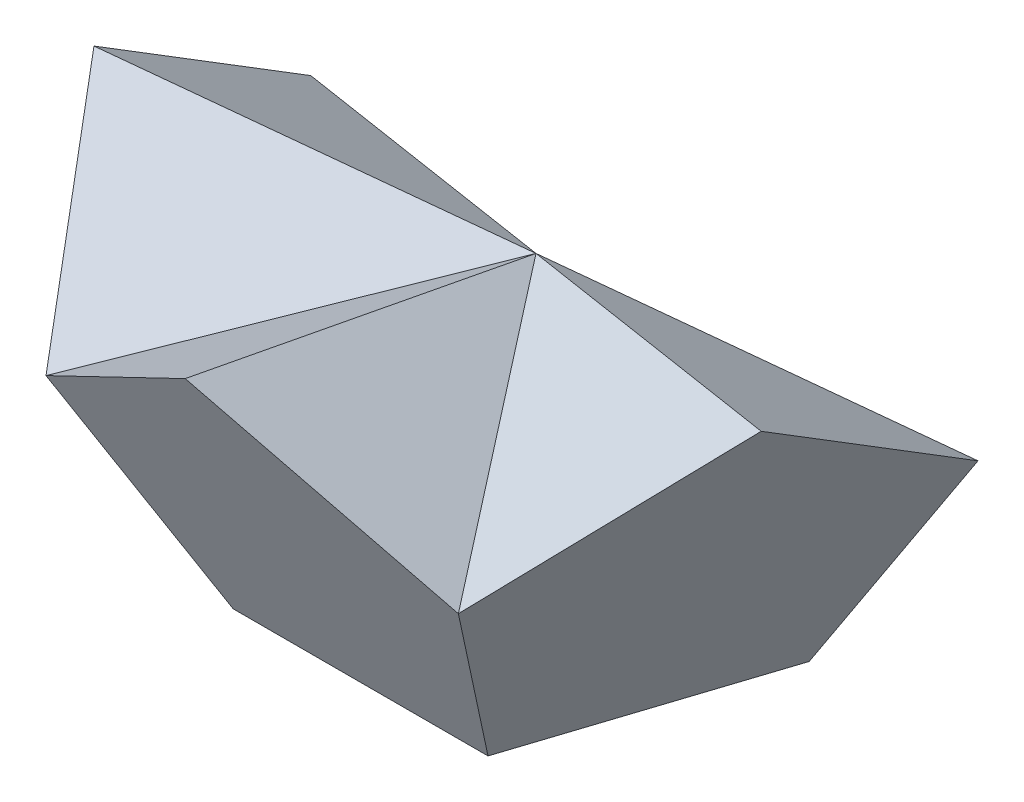
ISO-10303-21;
HEADER;
FILE_DESCRIPTION(('STEP AP214'),'2;1');
FILE_NAME('part.step','',(''),(''),'','','');
FILE_SCHEMA(('AUTOMOTIVE_DESIGN { 1 0 10303 214 1 1 1 1 }'));
ENDSEC;
DATA;
#1=APPLICATION_CONTEXT('core data for automotive mechanical design processes');
#2=APPLICATION_PROTOCOL_DEFINITION('international standard','automotive_design',2000,#1);
#3=PRODUCT_CONTEXT('',#1,'mechanical');
#4=PRODUCT('Part','Part','',(#3));
#5=PRODUCT_RELATED_PRODUCT_CATEGORY('part','',(#4));
#6=PRODUCT_DEFINITION_FORMATION('','',#4);
#7=PRODUCT_DEFINITION_CONTEXT('part definition',#1,'design');
#8=PRODUCT_DEFINITION('design','',#6,#7);
#9=PRODUCT_DEFINITION_SHAPE('','',#8);
#10=(LENGTH_UNIT() NAMED_UNIT(*) SI_UNIT(.MILLI.,.METRE.));
#11=(NAMED_UNIT(*) PLANE_ANGLE_UNIT() SI_UNIT($,.RADIAN.));
#12=(NAMED_UNIT(*) SI_UNIT($,.STERADIAN.) SOLID_ANGLE_UNIT());
#13=UNCERTAINTY_MEASURE_WITH_UNIT(LENGTH_MEASURE(1.E-05),#10,'distance_accuracy_value','');
#14=(GEOMETRIC_REPRESENTATION_CONTEXT(3) GLOBAL_UNCERTAINTY_ASSIGNED_CONTEXT((#13)) GLOBAL_UNIT_ASSIGNED_CONTEXT((#10,
#11,#12)) REPRESENTATION_CONTEXT('',''));
#15=CARTESIAN_POINT('',(0.,0.,0.));
#16=DIRECTION('',(0.,0.,1.));
#17=DIRECTION('',(1.,0.,0.));
#18=AXIS2_PLACEMENT_3D('',#15,#16,#17);
#19=CARTESIAN_POINT('',(10.2745158285618,0.,-3.33839256195651));
#20=DIRECTION('',(0.499999999999999,0.525731112119135,-0.688190960235587));
#21=DIRECTION('',(0.,0.794654472291766,0.607061998206687));
#22=AXIS2_PLACEMENT_3D('',#19,#20,#21);
#23=PLANE('',#22);
#24=DIRECTION('',(-0.809016994374948,0.,-0.587785252292472));
#25=VECTOR('',#24,1.);
#26=CARTESIAN_POINT('',(10.2745158285618,0.,-3.33839256195651));
#27=LINE('',#26,#25);
#28=CARTESIAN_POINT('',(10.2745158285618,0.,-3.33839256195651));
#29=VERTEX_POINT('',#28);
#30=CARTESIAN_POINT('',(0.,0.,-10.8032652660709));
#31=VERTEX_POINT('',#30);
#32=EDGE_CURVE('E171',#29,#31,#27,.T.);
#33=ORIENTED_EDGE('',*,*,#32,.T.);
#34=DIRECTION('',(0.,-0.794654472291765,-0.607061998206687));
#35=VECTOR('',#34,1.);
#36=CARTESIAN_POINT('',(0.,0.,-10.8032652660709));
#37=LINE('',#36,#35);
#38=CARTESIAN_POINT('',(0.,14.1416578280274,0.));
#39=VERTEX_POINT('',#38);
#40=EDGE_CURVE('E11',#39,#31,#37,.T.);
#41=ORIENTED_EDGE('',*,*,#40,.F.);
#42=DIRECTION('',(0.577350269189626,-0.794654472291765,-0.187592474085081));
#43=VECTOR('',#42,1.);
#44=CARTESIAN_POINT('',(10.2745158285618,0.,-3.33839256195651));
#45=LINE('',#44,#43);
#46=EDGE_CURVE('E60',#39,#29,#45,.T.);
#47=ORIENTED_EDGE('',*,*,#46,.T.);
#48=EDGE_LOOP('',(#33,#41,#47));
#49=FACE_BOUND('',#48,.T.);
#50=ADVANCED_FACE('F40',(#49),#23,.T.);
#51=CARTESIAN_POINT('',(0.,0.,-10.8032652660709));
#52=DIRECTION('',(-0.500000000000001,0.525731112119135,-0.688190960235585));
#53=DIRECTION('',(0.,0.794654472291765,0.607061998206688));
#54=AXIS2_PLACEMENT_3D('',#51,#52,#53);
#55=PLANE('',#54);
#56=DIRECTION('',(-0.809016994374946,0.,0.587785252292474));
#57=VECTOR('',#56,1.);
#58=CARTESIAN_POINT('',(0.,0.,-10.8032652660709));
#59=LINE('',#58,#57);
#60=CARTESIAN_POINT('',(-10.2745158285618,0.,-3.33839256195648));
#61=VERTEX_POINT('',#60);
#62=EDGE_CURVE('E67',#31,#61,#59,.T.);
#63=ORIENTED_EDGE('',*,*,#62,.T.);
#64=DIRECTION('',(-0.577350269189627,-0.794654472291765,-0.187592474085079));
#65=VECTOR('',#64,1.);
#66=CARTESIAN_POINT('',(-10.2745158285618,0.,-3.33839256195648));
#67=LINE('',#66,#65);
#68=EDGE_CURVE('E44',#39,#61,#67,.T.);
#69=ORIENTED_EDGE('',*,*,#68,.F.);
#70=ORIENTED_EDGE('',*,*,#40,.T.);
#71=EDGE_LOOP('',(#63,#69,#70));
#72=FACE_BOUND('',#71,.T.);
#73=ADVANCED_FACE('F42',(#72),#55,.T.);
#74=CARTESIAN_POINT('',(0.,0.,0.));
#75=DIRECTION('',(0.,1.,0.));
#76=DIRECTION('',(0.,0.,1.));
#77=AXIS2_PLACEMENT_3D('',#74,#75,#76);
#78=PLANE('',#77);
#79=ORIENTED_EDGE('',*,*,#32,.F.);
#80=DIRECTION('',(0.309016994374946,0.,-0.951056516295154));
#81=VECTOR('',#80,1.);
#82=CARTESIAN_POINT('',(6.35000000000002,0.,8.74002519499195));
#83=LINE('',#82,#81);
#84=CARTESIAN_POINT('',(6.35000000000002,0.,8.74002519499195));
#85=VERTEX_POINT('',#84);
#86=EDGE_CURVE('E182',#85,#29,#83,.T.);
#87=ORIENTED_EDGE('',*,*,#86,.F.);
#88=DIRECTION('',(1.,0.,0.));
#89=VECTOR('',#88,1.);
#90=CARTESIAN_POINT('',(-6.34999999999999,0.,8.74002519499197));
#91=LINE('',#90,#89);
#92=CARTESIAN_POINT('',(-6.34999999999999,0.,8.74002519499197));
#93=VERTEX_POINT('',#92);
#94=EDGE_CURVE('E179',#93,#85,#91,.T.);
#95=ORIENTED_EDGE('',*,*,#94,.F.);
#96=DIRECTION('',(0.309016994374949,0.,0.951056516295153));
#97=VECTOR('',#96,1.);
#98=CARTESIAN_POINT('',(-10.2745158285618,0.,-3.33839256195648));
#99=LINE('',#98,#97);
#100=EDGE_CURVE('E176',#61,#93,#99,.T.);
#101=ORIENTED_EDGE('',*,*,#100,.F.);
#102=ORIENTED_EDGE('',*,*,#62,.F.);
#103=EDGE_LOOP('',(#79,#87,#95,#101,#102));
#104=FACE_BOUND('',#103,.T.);
#105=ADVANCED_FACE('F192',(#104),#78,.F.);
#106=CARTESIAN_POINT('',(10.2745158285618,0.,-3.33839256195651));
#107=DIRECTION('',(-0.30901699437495,0.,-0.951056516295153));
#108=DIRECTION('',(-0.951056516295153,0.,0.30901699437495));
#109=AXIS2_PLACEMENT_3D('',#106,#107,#108);
#110=PLANE('',#109);
#111=DIRECTION('',(0.499999999999998,0.850650808352041,-0.162459848116455));
#112=VECTOR('',#111,1.);
#113=CARTESIAN_POINT('',(10.2745158285618,0.,-3.33839256195651));
#114=LINE('',#113,#112);
#115=CARTESIAN_POINT('',(16.6245158285618,10.8032652660709,-5.40163263303549));
#116=VERTEX_POINT('',#115);
#117=EDGE_CURVE('E145',#29,#116,#114,.T.);
#118=ORIENTED_EDGE('',*,*,#117,.F.);
#119=ORIENTED_EDGE('',*,*,#46,.F.);
#120=DIRECTION('',(0.934172358962715,-0.187592474085077,-0.303530999103346));
#121=VECTOR('',#120,1.);
#122=CARTESIAN_POINT('',(12.3911824952285,11.6533669266559,-4.02613925231617));
#123=LINE('',#122,#121);
#124=EDGE_CURVE('E161',#39,#116,#123,.T.);
#125=ORIENTED_EDGE('',*,*,#124,.T.);
#126=EDGE_LOOP('',(#118,#119,#125));
#127=FACE_BOUND('',#126,.T.);
#128=ADVANCED_FACE('F215',(#127),#110,.T.);
#129=CARTESIAN_POINT('',(16.6245158285618,17.4800503899839,5.40163263303542));
#130=DIRECTION('',(-0.309016994374949,0.85065080835204,0.425325404176019));
#131=DIRECTION('',(0.,-0.447213595499957,0.894427190999916));
#132=AXIS2_PLACEMENT_3D('',#129,#130,#131);
#133=PLANE('',#132);
#134=DIRECTION('',(-0.499999999999998,-0.525731112119134,0.688190960235588));
#135=VECTOR('',#134,1.);
#136=CARTESIAN_POINT('',(16.6245158285618,17.4800503899839,5.40163263303542));
#137=LINE('',#136,#135);
#138=CARTESIAN_POINT('',(16.6245158285618,17.4800503899839,5.40163263303542));
#139=VERTEX_POINT('',#138);
#140=CARTESIAN_POINT('',(10.2745158285619,10.8032652660709,14.1416578280274));
#141=VERTEX_POINT('',#140);
#142=EDGE_CURVE('E153',#139,#141,#137,.T.);
#143=ORIENTED_EDGE('',*,*,#142,.F.);
#144=DIRECTION('',(0.934172358962715,0.187592474085083,0.303530999103341));
#145=VECTOR('',#144,1.);
#146=CARTESIAN_POINT('',(12.3911824952285,16.6299487293989,4.02613925231612));
#147=LINE('',#146,#145);
#148=EDGE_CURVE('E164',#39,#139,#147,.T.);
#149=ORIENTED_EDGE('',*,*,#148,.F.);
#150=DIRECTION('',(0.577350269189626,-0.187592474085078,0.794654472291766));
#151=VECTOR('',#150,1.);
#152=CARTESIAN_POINT('',(7.65817194285393,11.6533669266559,10.5405694060037));
#153=LINE('',#152,#151);
#154=EDGE_CURVE('E167',#39,#141,#153,.T.);
#155=ORIENTED_EDGE('',*,*,#154,.T.);
#156=EDGE_LOOP('',(#143,#149,#155));
#157=FACE_BOUND('',#156,.T.);
#158=ADVANCED_FACE('F206',(#157),#133,.T.);
#159=CARTESIAN_POINT('',(16.6245158285618,10.8032652660709,-5.40163263303549));
#160=DIRECTION('',(0.,0.85065080835204,-0.525731112119134));
#161=DIRECTION('',(0.,0.525731112119134,0.85065080835204));
#162=AXIS2_PLACEMENT_3D('',#159,#160,#161);
#163=PLANE('',#162);
#164=DIRECTION('',(0.,0.525731112119134,0.85065080835204));
#165=VECTOR('',#164,1.);
#166=CARTESIAN_POINT('',(16.6245158285618,10.8032652660709,-5.40163263303549));
#167=LINE('',#166,#165);
#168=EDGE_CURVE('E157',#116,#139,#167,.T.);
#169=ORIENTED_EDGE('',*,*,#168,.F.);
#170=ORIENTED_EDGE('',*,*,#124,.F.);
#171=ORIENTED_EDGE('',*,*,#148,.T.);
#172=EDGE_LOOP('',(#169,#170,#171));
#173=FACE_BOUND('',#172,.T.);
#174=ADVANCED_FACE('F213',(#173),#163,.T.);
#175=CARTESIAN_POINT('',(12.0296126628495,7.81731618442516,3.90865809221255));
#176=DIRECTION('',(-0.850650808352041,0.447213595499956,-0.27639320225002));
#177=DIRECTION('',(-0.425325404176017,-0.27639320225002,0.861803398874991));
#178=AXIS2_PLACEMENT_3D('',#175,#176,#177);
#179=PLANE('',#178);
#180=ORIENTED_EDGE('',*,*,#117,.T.);
#181=ORIENTED_EDGE('',*,*,#168,.T.);
#182=ORIENTED_EDGE('',*,*,#142,.T.);
#183=DIRECTION('',(-0.309016994374946,-0.850650808352041,-0.425325404176019));
#184=VECTOR('',#183,1.);
#185=CARTESIAN_POINT('',(10.2745158285618,10.8032652660709,14.1416578280274));
#186=LINE('',#185,#184);
#187=EDGE_CURVE('E149',#141,#85,#186,.T.);
#188=ORIENTED_EDGE('',*,*,#187,.T.);
#189=ORIENTED_EDGE('',*,*,#86,.T.);
#190=EDGE_LOOP('',(#180,#181,#182,#188,#189));
#191=FACE_BOUND('',#190,.T.);
#192=ADVANCED_FACE('F209',(#191),#179,.F.);
#193=CARTESIAN_POINT('',(10.2745158285619,10.8032652660709,14.1416578280274));
#194=DIRECTION('',(0.5,0.850650808352039,-0.162459848116457));
#195=DIRECTION('',(-0.862103722396976,0.506731853971386,0.));
#196=AXIS2_PLACEMENT_3D('',#193,#194,#195);
#197=PLANE('',#196);
#198=DIRECTION('',(-0.809016994374947,0.525731112119134,0.262865556059567));
#199=VECTOR('',#198,1.);
#200=CARTESIAN_POINT('',(10.2745158285619,10.8032652660709,14.1416578280274));
#201=LINE('',#200,#199);
#202=CARTESIAN_POINT('',(0.,17.4800503899839,17.4800503899839));
#203=VERTEX_POINT('',#202);
#204=EDGE_CURVE('E116',#141,#203,#201,.T.);
#205=ORIENTED_EDGE('',*,*,#204,.F.);
#206=ORIENTED_EDGE('',*,*,#154,.F.);
#207=DIRECTION('',(0.,0.187592474085083,0.982246946376845));
#208=VECTOR('',#207,1.);
#209=CARTESIAN_POINT('',(0.,16.6299487293989,13.0288603073752));
#210=LINE('',#209,#208);
#211=EDGE_CURVE('E142',#39,#203,#210,.T.);
#212=ORIENTED_EDGE('',*,*,#211,.T.);
#213=EDGE_LOOP('',(#205,#206,#212));
#214=FACE_BOUND('',#213,.T.);
#215=ADVANCED_FACE('F202',(#214),#197,.T.);
#216=CARTESIAN_POINT('',(0.,17.4800503899839,17.4800503899839));
#217=DIRECTION('',(-0.5,0.85065080835204,-0.162459848116455));
#218=DIRECTION('',(-0.862103722396976,-0.506731853971386,0.));
#219=AXIS2_PLACEMENT_3D('',#216,#217,#218);
#220=PLANE('',#219);
#221=DIRECTION('',(-0.809016994374948,-0.525731112119134,-0.262865556059564));
#222=VECTOR('',#221,1.);
#223=CARTESIAN_POINT('',(0.,17.4800503899839,17.4800503899839));
#224=LINE('',#223,#222);
#225=CARTESIAN_POINT('',(-10.2745158285618,10.8032652660709,14.1416578280274));
#226=VERTEX_POINT('',#225);
#227=EDGE_CURVE('E139',#203,#226,#224,.T.);
#228=ORIENTED_EDGE('',*,*,#227,.F.);
#229=ORIENTED_EDGE('',*,*,#211,.F.);
#230=DIRECTION('',(-0.577350269189625,-0.187592474085077,0.794654472291767));
#231=VECTOR('',#230,1.);
#232=CARTESIAN_POINT('',(-7.65817194285392,11.6533669266559,10.5405694060038));
#233=LINE('',#232,#231);
#234=EDGE_CURVE('E112',#39,#226,#233,.T.);
#235=ORIENTED_EDGE('',*,*,#234,.T.);
#236=EDGE_LOOP('',(#228,#229,#235));
#237=FACE_BOUND('',#236,.T.);
#238=ADVANCED_FACE('F199',(#237),#220,.T.);
#239=CARTESIAN_POINT('',(0.,7.81731618442516,12.6486832872045));
#240=DIRECTION('',(0.,0.447213595499956,-0.894427190999917));
#241=DIRECTION('',(0.,-0.894427190999917,-0.447213595499956));
#242=AXIS2_PLACEMENT_3D('',#239,#240,#241);
#243=PLANE('',#242);
#244=ORIENTED_EDGE('',*,*,#204,.T.);
#245=ORIENTED_EDGE('',*,*,#227,.T.);
#246=DIRECTION('',(0.309016994374946,-0.850650808352041,-0.425325404176019));
#247=VECTOR('',#246,1.);
#248=CARTESIAN_POINT('',(-10.2745158285618,10.8032652660709,14.1416578280274));
#249=LINE('',#248,#247);
#250=EDGE_CURVE('E128',#226,#93,#249,.T.);
#251=ORIENTED_EDGE('',*,*,#250,.T.);
#252=ORIENTED_EDGE('',*,*,#94,.T.);
#253=ORIENTED_EDGE('',*,*,#187,.F.);
#254=EDGE_LOOP('',(#244,#245,#251,#252,#253));
#255=FACE_BOUND('',#254,.T.);
#256=ADVANCED_FACE('F196',(#255),#243,.F.);
#257=CARTESIAN_POINT('',(-16.6245158285618,17.4800503899839,5.40163263303547));
#258=DIRECTION('',(0.,0.85065080835204,-0.525731112119134));
#259=DIRECTION('',(0.,0.525731112119134,0.85065080835204));
#260=AXIS2_PLACEMENT_3D('',#257,#258,#259);
#261=PLANE('',#260);
#262=DIRECTION('',(0.,-0.525731112119134,-0.85065080835204));
#263=VECTOR('',#262,1.);
#264=CARTESIAN_POINT('',(-16.6245158285618,17.4800503899839,5.40163263303547));
#265=LINE('',#264,#263);
#266=CARTESIAN_POINT('',(-16.6245158285618,17.4800503899839,5.40163263303547));
#267=VERTEX_POINT('',#266);
#268=CARTESIAN_POINT('',(-16.6245158285618,10.8032652660709,-5.40163263303544));
#269=VERTEX_POINT('',#268);
#270=EDGE_CURVE('E120',#267,#269,#265,.T.);
#271=ORIENTED_EDGE('',*,*,#270,.F.);
#272=DIRECTION('',(-0.934172358962715,0.187592474085083,0.303530999103344));
#273=VECTOR('',#272,1.);
#274=CARTESIAN_POINT('',(-12.3911824952285,16.6299487293989,4.02613925231616));
#275=LINE('',#274,#273);
#276=EDGE_CURVE('E105',#39,#267,#275,.T.);
#277=ORIENTED_EDGE('',*,*,#276,.F.);
#278=DIRECTION('',(-0.934172358962716,-0.187592474085077,-0.303530999103343));
#279=VECTOR('',#278,1.);
#280=CARTESIAN_POINT('',(-12.3911824952285,11.6533669266559,-4.02613925231614));
#281=LINE('',#280,#279);
#282=EDGE_CURVE('E117',#39,#269,#281,.T.);
#283=ORIENTED_EDGE('',*,*,#282,.T.);
#284=EDGE_LOOP('',(#271,#277,#283));
#285=FACE_BOUND('',#284,.T.);
#286=ADVANCED_FACE('F121',(#285),#261,.T.);
#287=CARTESIAN_POINT('',(-10.2745158285618,10.8032652660709,14.1416578280274));
#288=DIRECTION('',(0.309016994374951,0.85065080835204,0.425325404176018));
#289=DIRECTION('',(0.,-0.447213595499957,0.894427190999917));
#290=AXIS2_PLACEMENT_3D('',#287,#288,#289);
#291=PLANE('',#290);
#292=DIRECTION('',(-0.5,0.525731112119134,-0.688190960235586));
#293=VECTOR('',#292,1.);
#294=CARTESIAN_POINT('',(-10.2745158285618,10.8032652660709,14.1416578280274));
#295=LINE('',#294,#293);
#296=EDGE_CURVE('E109',#226,#267,#295,.T.);
#297=ORIENTED_EDGE('',*,*,#296,.F.);
#298=ORIENTED_EDGE('',*,*,#234,.F.);
#299=ORIENTED_EDGE('',*,*,#276,.T.);
#300=EDGE_LOOP('',(#297,#298,#299));
#301=FACE_BOUND('',#300,.T.);
#302=ADVANCED_FACE('F107',(#301),#291,.T.);
#303=CARTESIAN_POINT('',(-16.6245158285618,10.8032652660709,-5.40163263303544));
#304=DIRECTION('',(0.309016994374947,0.,-0.951056516295154));
#305=DIRECTION('',(-0.951056516295154,0.,-0.309016994374947));
#306=AXIS2_PLACEMENT_3D('',#303,#304,#305);
#307=PLANE('',#306);
#308=DIRECTION('',(0.499999999999999,-0.850650808352041,0.162459848116453));
#309=VECTOR('',#308,1.);
#310=CARTESIAN_POINT('',(-16.6245158285618,10.8032652660709,-5.40163263303544));
#311=LINE('',#310,#309);
#312=EDGE_CURVE('E129',#269,#61,#311,.T.);
#313=ORIENTED_EDGE('',*,*,#312,.F.);
#314=ORIENTED_EDGE('',*,*,#282,.F.);
#315=ORIENTED_EDGE('',*,*,#68,.T.);
#316=EDGE_LOOP('',(#313,#314,#315));
#317=FACE_BOUND('',#316,.T.);
#318=ADVANCED_FACE('F189',(#317),#307,.T.);
#319=CARTESIAN_POINT('',(-12.0296126628494,7.81731618442516,3.90865809221258));
#320=DIRECTION('',(0.850650808352041,0.447213595499956,-0.276393202250023));
#321=DIRECTION('',(0.425325404176021,-0.276393202250023,0.861803398874988));
#322=AXIS2_PLACEMENT_3D('',#319,#320,#321);
#323=PLANE('',#322);
#324=ORIENTED_EDGE('',*,*,#270,.T.);
#325=ORIENTED_EDGE('',*,*,#312,.T.);
#326=ORIENTED_EDGE('',*,*,#100,.T.);
#327=ORIENTED_EDGE('',*,*,#250,.F.);
#328=ORIENTED_EDGE('',*,*,#296,.T.);
#329=EDGE_LOOP('',(#324,#325,#326,#327,#328));
#330=FACE_BOUND('',#329,.T.);
#331=ADVANCED_FACE('F126',(#330),#323,.F.);
#332=CLOSED_SHELL('',(#50,#73,#105,#128,#158,#174,#192,#215,#238,#256,#286,#302,#318,#331));
#333=MANIFOLD_SOLID_BREP('B2',#332);
#334=ADVANCED_BREP_SHAPE_REPRESENTATION('',(#18,#333),#14);
#335=SHAPE_DEFINITION_REPRESENTATION(#9,#334);
ENDSEC;
END-ISO-10303-21;
